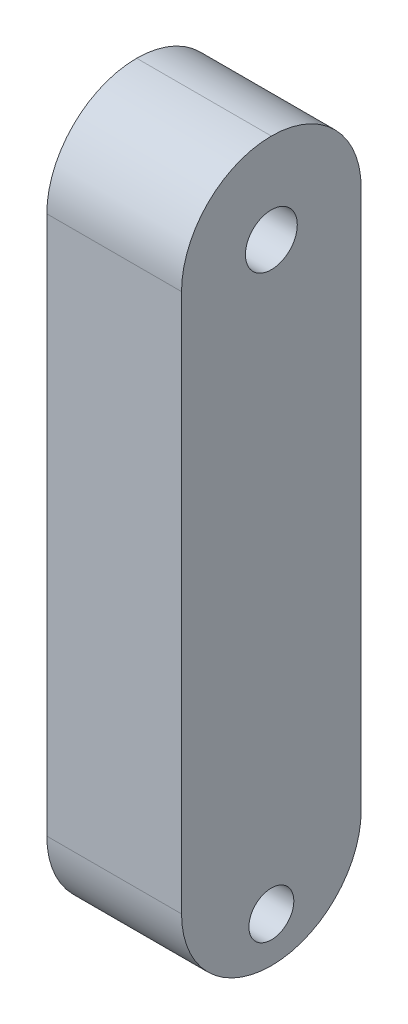
ISO-10303-21;
HEADER;
FILE_DESCRIPTION(('STEP AP214'),'2;1');
FILE_NAME('part.step','',(''),(''),'','','');
FILE_SCHEMA(('AUTOMOTIVE_DESIGN { 1 0 10303 214 1 1 1 1 }'));
ENDSEC;
DATA;
#1=APPLICATION_CONTEXT('core data for automotive mechanical design processes');
#2=APPLICATION_PROTOCOL_DEFINITION('international standard','automotive_design',2000,#1);
#3=PRODUCT_CONTEXT('',#1,'mechanical');
#4=PRODUCT('Part','Part','',(#3));
#5=PRODUCT_RELATED_PRODUCT_CATEGORY('part','',(#4));
#6=PRODUCT_DEFINITION_FORMATION('','',#4);
#7=PRODUCT_DEFINITION_CONTEXT('part definition',#1,'design');
#8=PRODUCT_DEFINITION('design','',#6,#7);
#9=PRODUCT_DEFINITION_SHAPE('','',#8);
#10=(LENGTH_UNIT() NAMED_UNIT(*) SI_UNIT(.MILLI.,.METRE.));
#11=(NAMED_UNIT(*) PLANE_ANGLE_UNIT() SI_UNIT($,.RADIAN.));
#12=(NAMED_UNIT(*) SI_UNIT($,.STERADIAN.) SOLID_ANGLE_UNIT());
#13=UNCERTAINTY_MEASURE_WITH_UNIT(LENGTH_MEASURE(1.E-05),#10,'distance_accuracy_value','');
#14=(GEOMETRIC_REPRESENTATION_CONTEXT(3) GLOBAL_UNCERTAINTY_ASSIGNED_CONTEXT((#13)) GLOBAL_UNIT_ASSIGNED_CONTEXT((#10,
#11,#12)) REPRESENTATION_CONTEXT('',''));
#15=CARTESIAN_POINT('',(0.,0.,0.));
#16=DIRECTION('',(0.,0.,1.));
#17=DIRECTION('',(1.,0.,0.));
#18=AXIS2_PLACEMENT_3D('',#15,#16,#17);
#19=CARTESIAN_POINT('',(19.05,101.6,25.4));
#20=DIRECTION('',(-1.,0.,0.));
#21=DIRECTION('',(0.,0.,1.));
#22=AXIS2_PLACEMENT_3D('',#19,#20,#21);
#23=PLANE('',#22);
#24=CARTESIAN_POINT('',(19.05,76.2000000000019,-5.82867087928207E-13));
#25=DIRECTION('',(-1.,0.,0.));
#26=DIRECTION('',(0.,0.,1.));
#27=AXIS2_PLACEMENT_3D('',#24,#25,#26);
#28=CIRCLE('',#27,7.33234841870827);
#29=CARTESIAN_POINT('',(19.05,76.2000000000019,7.33234841870769));
#30=VERTEX_POINT('',#29);
#31=EDGE_CURVE('E114',#30,#30,#28,.T.);
#32=ORIENTED_EDGE('',*,*,#31,.T.);
#33=EDGE_LOOP('',(#32));
#34=FACE_BOUND('',#33,.T.);
#35=CARTESIAN_POINT('',(19.05,-88.9,0.));
#36=DIRECTION('',(1.,0.,0.));
#37=DIRECTION('',(0.,0.,-1.));
#38=AXIS2_PLACEMENT_3D('',#35,#36,#37);
#39=CIRCLE('',#38,6.35);
#40=CARTESIAN_POINT('',(19.05,-88.9,-6.35));
#41=VERTEX_POINT('',#40);
#42=EDGE_CURVE('E134',#41,#41,#39,.T.);
#43=ORIENTED_EDGE('',*,*,#42,.F.);
#44=EDGE_LOOP('',(#43));
#45=FACE_BOUND('',#44,.T.);
#46=CARTESIAN_POINT('',(19.05,76.2,0.));
#47=DIRECTION('',(-1.,0.,0.));
#48=DIRECTION('',(0.,0.,1.));
#49=AXIS2_PLACEMENT_3D('',#46,#47,#48);
#50=CIRCLE('',#49,25.4);
#51=CARTESIAN_POINT('',(19.05,76.2,-25.4));
#52=VERTEX_POINT('',#51);
#53=CARTESIAN_POINT('',(19.05,101.6,0.));
#54=VERTEX_POINT('',#53);
#55=EDGE_CURVE('E116',#52,#54,#50,.F.);
#56=ORIENTED_EDGE('',*,*,#55,.T.);
#57=CARTESIAN_POINT('',(19.05,76.2,0.));
#58=DIRECTION('',(-1.,0.,0.));
#59=DIRECTION('',(0.,0.,1.));
#60=AXIS2_PLACEMENT_3D('',#57,#58,#59);
#61=CIRCLE('',#60,25.4);
#62=CARTESIAN_POINT('',(19.05,76.2,25.4));
#63=VERTEX_POINT('',#62);
#64=EDGE_CURVE('E118',#54,#63,#61,.F.);
#65=ORIENTED_EDGE('',*,*,#64,.T.);
#66=DIRECTION('',(0.,-1.,0.));
#67=VECTOR('',#66,1.);
#68=CARTESIAN_POINT('',(19.05,101.6,25.4));
#69=LINE('',#68,#67);
#70=CARTESIAN_POINT('',(19.05,-76.2,25.4));
#71=VERTEX_POINT('',#70);
#72=EDGE_CURVE('E106',#63,#71,#69,.T.);
#73=ORIENTED_EDGE('',*,*,#72,.T.);
#74=CARTESIAN_POINT('',(19.05,-76.2,0.));
#75=DIRECTION('',(-1.,0.,0.));
#76=DIRECTION('',(0.,0.,1.));
#77=AXIS2_PLACEMENT_3D('',#74,#75,#76);
#78=CIRCLE('',#77,25.4);
#79=CARTESIAN_POINT('',(19.05,-101.6,0.));
#80=VERTEX_POINT('',#79);
#81=EDGE_CURVE('E99',#71,#80,#78,.F.);
#82=ORIENTED_EDGE('',*,*,#81,.T.);
#83=CARTESIAN_POINT('',(19.05,-76.2,0.));
#84=DIRECTION('',(-1.,0.,0.));
#85=DIRECTION('',(0.,0.,1.));
#86=AXIS2_PLACEMENT_3D('',#83,#84,#85);
#87=CIRCLE('',#86,25.4);
#88=CARTESIAN_POINT('',(19.05,-76.2,-25.4));
#89=VERTEX_POINT('',#88);
#90=EDGE_CURVE('E103',#80,#89,#87,.F.);
#91=ORIENTED_EDGE('',*,*,#90,.T.);
#92=DIRECTION('',(0.,-1.,0.));
#93=VECTOR('',#92,1.);
#94=CARTESIAN_POINT('',(19.05,101.6,-25.4));
#95=LINE('',#94,#93);
#96=EDGE_CURVE('E109',#52,#89,#95,.T.);
#97=ORIENTED_EDGE('',*,*,#96,.F.);
#98=EDGE_LOOP('',(#56,#65,#73,#82,#91,#97));
#99=FACE_BOUND('',#98,.T.);
#100=ADVANCED_FACE('F43',(#34,#45,#99),#23,.F.);
#101=CARTESIAN_POINT('',(-19.05,101.6,-25.4));
#102=DIRECTION('',(0.,0.,1.));
#103=DIRECTION('',(1.,0.,0.));
#104=AXIS2_PLACEMENT_3D('',#101,#102,#103);
#105=PLANE('',#104);
#106=DIRECTION('',(0.,-1.,0.));
#107=VECTOR('',#106,1.);
#108=CARTESIAN_POINT('',(-19.05,101.6,-25.4));
#109=LINE('',#108,#107);
#110=CARTESIAN_POINT('',(-19.05,76.2,-25.4));
#111=VERTEX_POINT('',#110);
#112=CARTESIAN_POINT('',(-19.05,-76.2,-25.4));
#113=VERTEX_POINT('',#112);
#114=EDGE_CURVE('E151',#111,#113,#109,.T.);
#115=ORIENTED_EDGE('',*,*,#114,.F.);
#116=DIRECTION('',(-1.,0.,0.));
#117=VECTOR('',#116,1.);
#118=CARTESIAN_POINT('',(-19.05,76.2,-25.4));
#119=LINE('',#118,#117);
#120=EDGE_CURVE('E11',#111,#52,#119,.F.);
#121=ORIENTED_EDGE('',*,*,#120,.T.);
#122=ORIENTED_EDGE('',*,*,#96,.T.);
#123=DIRECTION('',(-1.,0.,0.));
#124=VECTOR('',#123,1.);
#125=CARTESIAN_POINT('',(-19.05,-76.2,-25.4));
#126=LINE('',#125,#124);
#127=EDGE_CURVE('E52',#89,#113,#126,.T.);
#128=ORIENTED_EDGE('',*,*,#127,.T.);
#129=EDGE_LOOP('',(#115,#121,#122,#128));
#130=FACE_BOUND('',#129,.T.);
#131=ADVANCED_FACE('F153',(#130),#105,.F.);
#132=CARTESIAN_POINT('',(-19.05,101.6,25.4));
#133=DIRECTION('',(1.,0.,0.));
#134=DIRECTION('',(0.,0.,-1.));
#135=AXIS2_PLACEMENT_3D('',#132,#133,#134);
#136=PLANE('',#135);
#137=CARTESIAN_POINT('',(-19.05,76.2000000000019,-5.82867087928207E-13));
#138=DIRECTION('',(1.,0.,0.));
#139=DIRECTION('',(0.,0.,-1.));
#140=AXIS2_PLACEMENT_3D('',#137,#138,#139);
#141=CIRCLE('',#140,7.33234841870827);
#142=CARTESIAN_POINT('',(-19.05,76.2000000000019,-7.33234841870886));
#143=VERTEX_POINT('',#142);
#144=EDGE_CURVE('E255',#143,#143,#141,.T.);
#145=ORIENTED_EDGE('',*,*,#144,.T.);
#146=EDGE_LOOP('',(#145));
#147=FACE_BOUND('',#146,.T.);
#148=CARTESIAN_POINT('',(-19.05,-88.9,0.));
#149=DIRECTION('',(1.,0.,0.));
#150=DIRECTION('',(0.,0.,-1.));
#151=AXIS2_PLACEMENT_3D('',#148,#149,#150);
#152=CIRCLE('',#151,6.35);
#153=CARTESIAN_POINT('',(-19.05,-88.9,-6.35));
#154=VERTEX_POINT('',#153);
#155=EDGE_CURVE('E139',#154,#154,#152,.T.);
#156=ORIENTED_EDGE('',*,*,#155,.T.);
#157=EDGE_LOOP('',(#156));
#158=FACE_BOUND('',#157,.T.);
#159=DIRECTION('',(0.,-1.,0.));
#160=VECTOR('',#159,1.);
#161=CARTESIAN_POINT('',(-19.05,101.6,25.4));
#162=LINE('',#161,#160);
#163=CARTESIAN_POINT('',(-19.05,76.2,25.4));
#164=VERTEX_POINT('',#163);
#165=CARTESIAN_POINT('',(-19.05,-76.2,25.4));
#166=VERTEX_POINT('',#165);
#167=EDGE_CURVE('E148',#164,#166,#162,.T.);
#168=ORIENTED_EDGE('',*,*,#167,.F.);
#169=CARTESIAN_POINT('',(-19.05,76.2,0.));
#170=DIRECTION('',(1.,0.,0.));
#171=DIRECTION('',(0.,0.,-1.));
#172=AXIS2_PLACEMENT_3D('',#169,#170,#171);
#173=CIRCLE('',#172,25.4);
#174=CARTESIAN_POINT('',(-19.05,101.6,0.));
#175=VERTEX_POINT('',#174);
#176=EDGE_CURVE('E131',#164,#175,#173,.F.);
#177=ORIENTED_EDGE('',*,*,#176,.T.);
#178=CARTESIAN_POINT('',(-19.05,76.2,0.));
#179=DIRECTION('',(1.,0.,0.));
#180=DIRECTION('',(0.,0.,-1.));
#181=AXIS2_PLACEMENT_3D('',#178,#179,#180);
#182=CIRCLE('',#181,25.4);
#183=EDGE_CURVE('E68',#175,#111,#182,.F.);
#184=ORIENTED_EDGE('',*,*,#183,.T.);
#185=ORIENTED_EDGE('',*,*,#114,.T.);
#186=CARTESIAN_POINT('',(-19.05,-76.2,0.));
#187=DIRECTION('',(1.,0.,0.));
#188=DIRECTION('',(0.,0.,-1.));
#189=AXIS2_PLACEMENT_3D('',#186,#187,#188);
#190=CIRCLE('',#189,25.4);
#191=CARTESIAN_POINT('',(-19.05,-101.6,0.));
#192=VERTEX_POINT('',#191);
#193=EDGE_CURVE('E60',#113,#192,#190,.F.);
#194=ORIENTED_EDGE('',*,*,#193,.T.);
#195=CARTESIAN_POINT('',(-19.05,-76.2,0.));
#196=DIRECTION('',(1.,0.,0.));
#197=DIRECTION('',(0.,0.,-1.));
#198=AXIS2_PLACEMENT_3D('',#195,#196,#197);
#199=CIRCLE('',#198,25.4);
#200=EDGE_CURVE('E112',#192,#166,#199,.F.);
#201=ORIENTED_EDGE('',*,*,#200,.T.);
#202=EDGE_LOOP('',(#168,#177,#184,#185,#194,#201));
#203=FACE_BOUND('',#202,.T.);
#204=ADVANCED_FACE('F163',(#147,#158,#203),#136,.F.);
#205=CARTESIAN_POINT('',(-19.05,101.6,25.4));
#206=DIRECTION('',(0.,0.,-1.));
#207=DIRECTION('',(-1.,0.,0.));
#208=AXIS2_PLACEMENT_3D('',#205,#206,#207);
#209=PLANE('',#208);
#210=ORIENTED_EDGE('',*,*,#72,.F.);
#211=DIRECTION('',(1.,0.,0.));
#212=VECTOR('',#211,1.);
#213=CARTESIAN_POINT('',(-19.05,76.2,25.4));
#214=LINE('',#213,#212);
#215=EDGE_CURVE('E125',#63,#164,#214,.F.);
#216=ORIENTED_EDGE('',*,*,#215,.T.);
#217=ORIENTED_EDGE('',*,*,#167,.T.);
#218=DIRECTION('',(1.,0.,0.));
#219=VECTOR('',#218,1.);
#220=CARTESIAN_POINT('',(19.05,-76.2,25.4));
#221=LINE('',#220,#219);
#222=EDGE_CURVE('E123',#166,#71,#221,.T.);
#223=ORIENTED_EDGE('',*,*,#222,.T.);
#224=EDGE_LOOP('',(#210,#216,#217,#223));
#225=FACE_BOUND('',#224,.T.);
#226=ADVANCED_FACE('F161',(#225),#209,.F.);
#227=CARTESIAN_POINT('',(-19.05,-88.9,0.));
#228=DIRECTION('',(1.,0.,0.));
#229=DIRECTION('',(0.,0.,-1.));
#230=AXIS2_PLACEMENT_3D('',#227,#228,#229);
#231=CYLINDRICAL_SURFACE('',#230,6.35);
#232=CARTESIAN_POINT('',(-19.05,-88.9,-6.35));
#233=CARTESIAN_POINT('',(-18.653125,-88.9,-6.35));
#234=CARTESIAN_POINT('',(-18.25625,-88.9,-6.35));
#235=CARTESIAN_POINT('',(-17.4625,-88.9,-6.35));
#236=CARTESIAN_POINT('',(-17.065625,-88.9,-6.35));
#237=CARTESIAN_POINT('',(-16.271875,-88.9,-6.35));
#238=CARTESIAN_POINT('',(-15.875,-88.9,-6.35));
#239=CARTESIAN_POINT('',(-15.08125,-88.9,-6.35));
#240=CARTESIAN_POINT('',(-14.684375,-88.9,-6.35));
#241=CARTESIAN_POINT('',(-13.890625,-88.9,-6.35));
#242=CARTESIAN_POINT('',(-13.49375,-88.9,-6.35));
#243=CARTESIAN_POINT('',(-12.7,-88.9,-6.35));
#244=CARTESIAN_POINT('',(-12.303125,-88.9,-6.35));
#245=CARTESIAN_POINT('',(-11.509375,-88.9,-6.35));
#246=CARTESIAN_POINT('',(-11.1125,-88.9,-6.35));
#247=CARTESIAN_POINT('',(-10.31875,-88.9,-6.35));
#248=CARTESIAN_POINT('',(-9.92187499999999,-88.9,-6.35));
#249=CARTESIAN_POINT('',(-9.12812499999999,-88.9,-6.35));
#250=CARTESIAN_POINT('',(-8.73124999999999,-88.9,-6.35));
#251=CARTESIAN_POINT('',(-7.93749999999999,-88.9,-6.35));
#252=CARTESIAN_POINT('',(-7.54062499999999,-88.9,-6.35));
#253=CARTESIAN_POINT('',(-6.74687499999999,-88.9,-6.35));
#254=CARTESIAN_POINT('',(-6.34999999999999,-88.9,-6.35));
#255=CARTESIAN_POINT('',(-5.55624999999999,-88.9,-6.35));
#256=CARTESIAN_POINT('',(-5.15937499999999,-88.9,-6.35));
#257=CARTESIAN_POINT('',(-4.36562499999999,-88.9,-6.35));
#258=CARTESIAN_POINT('',(-3.96874999999999,-88.9,-6.35));
#259=CARTESIAN_POINT('',(-3.17499999999999,-88.9,-6.35));
#260=CARTESIAN_POINT('',(-2.77812499999999,-88.9,-6.35));
#261=CARTESIAN_POINT('',(-1.98437499999999,-88.9,-6.35));
#262=CARTESIAN_POINT('',(-1.58749999999999,-88.9,-6.35));
#263=CARTESIAN_POINT('',(-0.79374999999999,-88.9,-6.35));
#264=CARTESIAN_POINT('',(-0.39687499999999,-88.9,-6.35));
#265=CARTESIAN_POINT('',(0.396875000000011,-88.9,-6.35));
#266=CARTESIAN_POINT('',(0.793750000000011,-88.9,-6.35));
#267=CARTESIAN_POINT('',(1.58750000000001,-88.9,-6.35));
#268=CARTESIAN_POINT('',(1.98437500000001,-88.9,-6.35));
#269=CARTESIAN_POINT('',(2.77812500000001,-88.9,-6.35));
#270=CARTESIAN_POINT('',(3.17500000000001,-88.9,-6.35));
#271=CARTESIAN_POINT('',(3.96875000000001,-88.9,-6.35));
#272=CARTESIAN_POINT('',(4.36562500000001,-88.9,-6.35));
#273=CARTESIAN_POINT('',(5.15937500000001,-88.9,-6.35));
#274=CARTESIAN_POINT('',(5.55625000000001,-88.9,-6.35));
#275=CARTESIAN_POINT('',(6.35000000000001,-88.9,-6.35));
#276=CARTESIAN_POINT('',(6.74687500000001,-88.9,-6.35));
#277=CARTESIAN_POINT('',(7.54062500000001,-88.9,-6.35));
#278=CARTESIAN_POINT('',(7.93750000000001,-88.9,-6.35));
#279=CARTESIAN_POINT('',(8.73125000000001,-88.9,-6.35));
#280=CARTESIAN_POINT('',(9.12812500000001,-88.9,-6.35));
#281=CARTESIAN_POINT('',(9.92187500000001,-88.9,-6.35));
#282=CARTESIAN_POINT('',(10.31875,-88.9,-6.35));
#283=CARTESIAN_POINT('',(11.1125,-88.9,-6.35));
#284=CARTESIAN_POINT('',(11.509375,-88.9,-6.35));
#285=CARTESIAN_POINT('',(12.303125,-88.9,-6.35));
#286=CARTESIAN_POINT('',(12.7,-88.9,-6.35));
#287=CARTESIAN_POINT('',(13.49375,-88.9,-6.35));
#288=CARTESIAN_POINT('',(13.890625,-88.9,-6.35));
#289=CARTESIAN_POINT('',(14.684375,-88.9,-6.35));
#290=CARTESIAN_POINT('',(15.08125,-88.9,-6.35));
#291=CARTESIAN_POINT('',(15.875,-88.9,-6.35));
#292=CARTESIAN_POINT('',(16.271875,-88.9,-6.35));
#293=CARTESIAN_POINT('',(17.065625,-88.9,-6.35));
#294=CARTESIAN_POINT('',(17.4625,-88.9,-6.35));
#295=CARTESIAN_POINT('',(18.25625,-88.9,-6.35));
#296=CARTESIAN_POINT('',(18.653125,-88.9,-6.35));
#297=CARTESIAN_POINT('',(19.05,-88.9,-6.35));
#298=B_SPLINE_CURVE_WITH_KNOTS('',3,(#232,#233,#234,#235,#236,#237,#238,#239,#240,#241,#242,
#243,#244,#245,#246,#247,#248,#249,#250,#251,#252,#253,#254,#255,#256,#257,#258,#259,#260,#261,
#262,#263,#264,#265,#266,#267,#268,#269,#270,#271,#272,#273,#274,#275,#276,#277,#278,#279,#280,
#281,#282,#283,#284,#285,#286,#287,#288,#289,#290,#291,#292,#293,#294,#295,#296,#297),
.UNSPECIFIED.,.F.,.F.,(4,2,2,2,2,2,2,2,2,2,2,2,2,2,2,2,2,2,2,2,2,2,2,2,2,2,2,2,2,2,2,2,4),(0.,
1.190625,2.38125,3.571875,4.7625,5.953125,7.14375,8.334375,9.525,10.715625,11.90625,13.096875,
14.2875,15.478125,16.66875,17.859375,19.05,20.240625,21.43125,22.621875,23.8125,25.003125,
26.19375,27.384375,28.575,29.765625,30.95625,32.146875,33.3375,34.528125,35.71875,36.909375,
38.1),.UNSPECIFIED.);
#299=EDGE_CURVE('BSEAM172',#154,#41,#298,.T.);
#300=ORIENTED_EDGE('',*,*,#155,.F.);
#301=ORIENTED_EDGE('',*,*,#42,.T.);
#302=ORIENTED_EDGE('',*,*,#299,.T.);
#303=ORIENTED_EDGE('',*,*,#299,.F.);
#304=EDGE_LOOP('',(#300,#302,#301,#303));
#305=FACE_BOUND('',#304,.T.);
#306=ADVANCED_FACE('F172',(#305),#231,.F.);
#307=CARTESIAN_POINT('',(0.,76.2,0.));
#308=DIRECTION('',(-1.,0.,0.));
#309=DIRECTION('',(0.,0.,1.));
#310=AXIS2_PLACEMENT_3D('',#307,#308,#309);
#311=CYLINDRICAL_SURFACE('',#310,25.4);
#312=ORIENTED_EDGE('',*,*,#120,.F.);
#313=ORIENTED_EDGE('',*,*,#183,.F.);
#314=DIRECTION('',(-1.,0.,0.));
#315=VECTOR('',#314,1.);
#316=CARTESIAN_POINT('',(0.,101.6,0.));
#317=LINE('',#316,#315);
#318=EDGE_CURVE('E113',#54,#175,#317,.T.);
#319=ORIENTED_EDGE('',*,*,#318,.F.);
#320=ORIENTED_EDGE('',*,*,#55,.F.);
#321=EDGE_LOOP('',(#312,#313,#319,#320));
#322=FACE_BOUND('',#321,.T.);
#323=ADVANCED_FACE('F157',(#322),#311,.T.);
#324=CARTESIAN_POINT('',(0.,76.2,0.));
#325=DIRECTION('',(1.,0.,0.));
#326=DIRECTION('',(0.,0.,-1.));
#327=AXIS2_PLACEMENT_3D('',#324,#325,#326);
#328=CYLINDRICAL_SURFACE('',#327,25.4);
#329=ORIENTED_EDGE('',*,*,#176,.F.);
#330=ORIENTED_EDGE('',*,*,#215,.F.);
#331=ORIENTED_EDGE('',*,*,#64,.F.);
#332=ORIENTED_EDGE('',*,*,#318,.T.);
#333=EDGE_LOOP('',(#329,#330,#331,#332));
#334=FACE_BOUND('',#333,.T.);
#335=ADVANCED_FACE('F159',(#334),#328,.T.);
#336=CARTESIAN_POINT('',(-19.05,-76.2,0.));
#337=DIRECTION('',(-1.,0.,0.));
#338=DIRECTION('',(0.,0.,1.));
#339=AXIS2_PLACEMENT_3D('',#336,#337,#338);
#340=CYLINDRICAL_SURFACE('',#339,25.4);
#341=DIRECTION('',(1.,0.,0.));
#342=VECTOR('',#341,1.);
#343=CARTESIAN_POINT('',(-19.05,-101.6,0.));
#344=LINE('',#343,#342);
#345=EDGE_CURVE('E47',#80,#192,#344,.F.);
#346=ORIENTED_EDGE('',*,*,#345,.F.);
#347=ORIENTED_EDGE('',*,*,#81,.F.);
#348=ORIENTED_EDGE('',*,*,#222,.F.);
#349=ORIENTED_EDGE('',*,*,#200,.F.);
#350=EDGE_LOOP('',(#346,#347,#348,#349));
#351=FACE_BOUND('',#350,.T.);
#352=ADVANCED_FACE('F45',(#351),#340,.T.);
#353=CARTESIAN_POINT('',(-19.05,-76.2,0.));
#354=DIRECTION('',(1.,0.,0.));
#355=DIRECTION('',(0.,0.,-1.));
#356=AXIS2_PLACEMENT_3D('',#353,#354,#355);
#357=CYLINDRICAL_SURFACE('',#356,25.4);
#358=ORIENTED_EDGE('',*,*,#90,.F.);
#359=ORIENTED_EDGE('',*,*,#345,.T.);
#360=ORIENTED_EDGE('',*,*,#193,.F.);
#361=ORIENTED_EDGE('',*,*,#127,.F.);
#362=EDGE_LOOP('',(#358,#359,#360,#361));
#363=FACE_BOUND('',#362,.T.);
#364=ADVANCED_FACE('F115',(#363),#357,.T.);
#365=CARTESIAN_POINT('',(-19.05,76.2000000000019,-5.82867087928207E-13));
#366=DIRECTION('',(1.,0.,0.));
#367=DIRECTION('',(0.,0.,-1.));
#368=AXIS2_PLACEMENT_3D('',#365,#366,#367);
#369=CYLINDRICAL_SURFACE('',#368,7.33234841870827);
#370=ORIENTED_EDGE('',*,*,#144,.F.);
#371=EDGE_LOOP('',(#370));
#372=FACE_BOUND('',#371,.T.);
#373=ORIENTED_EDGE('',*,*,#31,.F.);
#374=EDGE_LOOP('',(#373));
#375=FACE_BOUND('',#374,.T.);
#376=ADVANCED_FACE('F189',(#372,#375),#369,.F.);
#377=CLOSED_SHELL('',(#100,#131,#204,#226,#306,#323,#335,#352,#364,#376));
#378=MANIFOLD_SOLID_BREP('B2',#377);
#379=ADVANCED_BREP_SHAPE_REPRESENTATION('',(#18,#378),#14);
#380=SHAPE_DEFINITION_REPRESENTATION(#9,#379);
ENDSEC;
END-ISO-10303-21;
